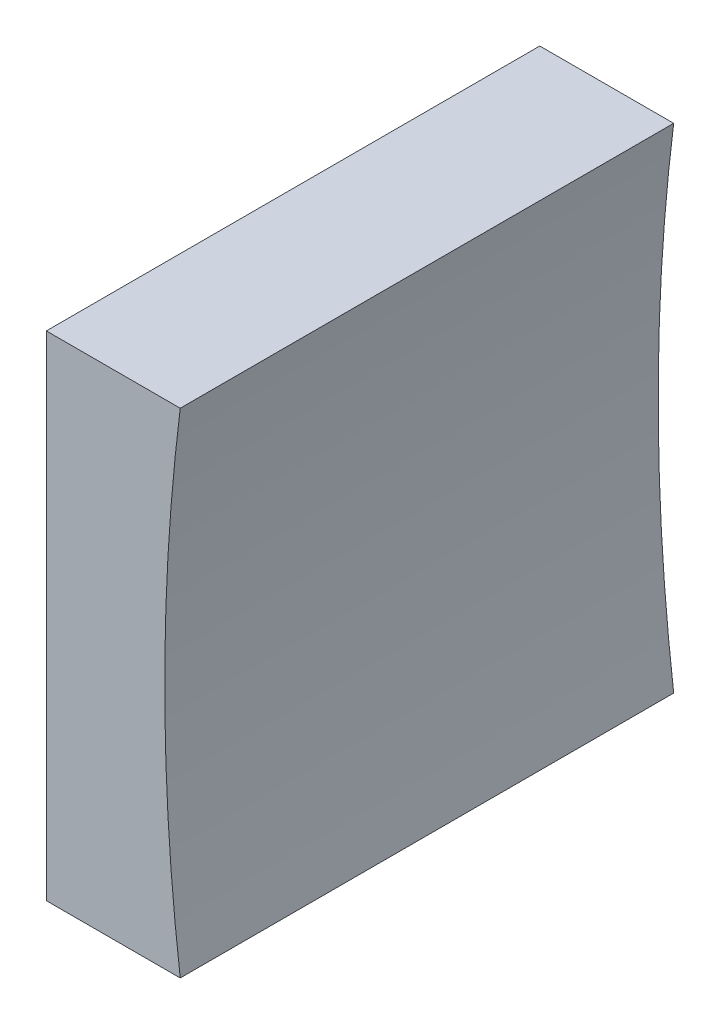
ISO-10303-21;
HEADER;
FILE_DESCRIPTION(('STEP AP214'),'2;1');
FILE_NAME('part.step','',(''),(''),'','','');
FILE_SCHEMA(('AUTOMOTIVE_DESIGN { 1 0 10303 214 1 1 1 1 }'));
ENDSEC;
DATA;
#1=APPLICATION_CONTEXT('core data for automotive mechanical design processes');
#2=APPLICATION_PROTOCOL_DEFINITION('international standard','automotive_design',2000,#1);
#3=PRODUCT_CONTEXT('',#1,'mechanical');
#4=PRODUCT('Part','Part','',(#3));
#5=PRODUCT_RELATED_PRODUCT_CATEGORY('part','',(#4));
#6=PRODUCT_DEFINITION_FORMATION('','',#4);
#7=PRODUCT_DEFINITION_CONTEXT('part definition',#1,'design');
#8=PRODUCT_DEFINITION('design','',#6,#7);
#9=PRODUCT_DEFINITION_SHAPE('','',#8);
#10=(LENGTH_UNIT() NAMED_UNIT(*) SI_UNIT(.MILLI.,.METRE.));
#11=(NAMED_UNIT(*) PLANE_ANGLE_UNIT() SI_UNIT($,.RADIAN.));
#12=(NAMED_UNIT(*) SI_UNIT($,.STERADIAN.) SOLID_ANGLE_UNIT());
#13=UNCERTAINTY_MEASURE_WITH_UNIT(LENGTH_MEASURE(1.E-05),#10,'distance_accuracy_value','');
#14=(GEOMETRIC_REPRESENTATION_CONTEXT(3) GLOBAL_UNCERTAINTY_ASSIGNED_CONTEXT((#13)) GLOBAL_UNIT_ASSIGNED_CONTEXT((#10,
#11,#12)) REPRESENTATION_CONTEXT('',''));
#15=CARTESIAN_POINT('',(0.,0.,0.));
#16=DIRECTION('',(0.,0.,1.));
#17=DIRECTION('',(1.,0.,0.));
#18=AXIS2_PLACEMENT_3D('',#15,#16,#17);
#19=CARTESIAN_POINT('',(145.745730748059,27.1789646338835,12.5));
#20=DIRECTION('',(0.,1.,0.));
#21=DIRECTION('',(0.,0.,1.));
#22=AXIS2_PLACEMENT_3D('',#19,#20,#21);
#23=PLANE('',#22);
#24=DIRECTION('',(1.,0.,0.));
#25=VECTOR('',#24,1.);
#26=CARTESIAN_POINT('',(145.745730748059,27.1789646338835,0.));
#27=LINE('',#26,#25);
#28=CARTESIAN_POINT('',(142.353567815641,27.1789646338835,0.));
#29=VERTEX_POINT('',#28);
#30=CARTESIAN_POINT('',(145.745730748059,27.1789646338836,0.));
#31=VERTEX_POINT('',#30);
#32=EDGE_CURVE('E91',#29,#31,#27,.T.);
#33=ORIENTED_EDGE('',*,*,#32,.T.);
#34=DIRECTION('',(0.,0.,-1.));
#35=VECTOR('',#34,1.);
#36=CARTESIAN_POINT('',(145.745730748059,27.1789646338836,12.5));
#37=LINE('',#36,#35);
#38=CARTESIAN_POINT('',(145.745730748059,27.1789646338836,12.5));
#39=VERTEX_POINT('',#38);
#40=EDGE_CURVE('E45',#39,#31,#37,.T.);
#41=ORIENTED_EDGE('',*,*,#40,.F.);
#42=DIRECTION('',(1.,0.,0.));
#43=VECTOR('',#42,1.);
#44=CARTESIAN_POINT('',(145.745730748059,27.1789646338835,12.5));
#45=LINE('',#44,#43);
#46=CARTESIAN_POINT('',(142.353567815641,27.1789646338835,12.5));
#47=VERTEX_POINT('',#46);
#48=EDGE_CURVE('E84',#47,#39,#45,.T.);
#49=ORIENTED_EDGE('',*,*,#48,.F.);
#50=DIRECTION('',(0.,0.,-1.));
#51=VECTOR('',#50,1.);
#52=CARTESIAN_POINT('',(142.353567815641,27.1789646338835,12.5));
#53=LINE('',#52,#51);
#54=EDGE_CURVE('E11',#47,#29,#53,.T.);
#55=ORIENTED_EDGE('',*,*,#54,.T.);
#56=EDGE_LOOP('',(#33,#41,#49,#55));
#57=FACE_BOUND('',#56,.T.);
#58=ADVANCED_FACE('F37',(#57),#23,.F.);
#59=CARTESIAN_POINT('',(195.35356783052,33.4289646338834,12.5));
#60=DIRECTION('',(0.,0.,-1.));
#61=DIRECTION('',(-1.,0.,0.));
#62=AXIS2_PLACEMENT_3D('',#59,#60,#61);
#63=CYLINDRICAL_SURFACE('',#62,50.);
#64=CARTESIAN_POINT('',(195.35356783052,33.4289646338834,0.));
#65=DIRECTION('',(0.,0.,-1.));
#66=DIRECTION('',(1.,0.,0.));
#67=AXIS2_PLACEMENT_3D('',#64,#65,#66);
#68=CIRCLE('',#67,50.);
#69=CARTESIAN_POINT('',(145.745730748059,39.6789646338835,0.));
#70=VERTEX_POINT('',#69);
#71=EDGE_CURVE('E71',#31,#70,#68,.T.);
#72=ORIENTED_EDGE('',*,*,#71,.T.);
#73=DIRECTION('',(0.,0.,-1.));
#74=VECTOR('',#73,1.);
#75=CARTESIAN_POINT('',(145.745730748059,39.6789646338835,12.5));
#76=LINE('',#75,#74);
#77=CARTESIAN_POINT('',(145.745730748059,39.6789646338835,12.5));
#78=VERTEX_POINT('',#77);
#79=EDGE_CURVE('E92',#78,#70,#76,.T.);
#80=ORIENTED_EDGE('',*,*,#79,.F.);
#81=CARTESIAN_POINT('',(195.35356783052,33.4289646338834,12.5));
#82=DIRECTION('',(0.,0.,-1.));
#83=DIRECTION('',(1.,0.,0.));
#84=AXIS2_PLACEMENT_3D('',#81,#82,#83);
#85=CIRCLE('',#84,50.);
#86=EDGE_CURVE('E88',#39,#78,#85,.T.);
#87=ORIENTED_EDGE('',*,*,#86,.F.);
#88=ORIENTED_EDGE('',*,*,#40,.T.);
#89=EDGE_LOOP('',(#72,#80,#87,#88));
#90=FACE_BOUND('',#89,.T.);
#91=ADVANCED_FACE('F93',(#90),#63,.F.);
#92=CARTESIAN_POINT('',(142.353567815641,39.6789646338835,12.5));
#93=DIRECTION('',(0.,-1.,0.));
#94=DIRECTION('',(0.,0.,-1.));
#95=AXIS2_PLACEMENT_3D('',#92,#93,#94);
#96=PLANE('',#95);
#97=DIRECTION('',(-1.,0.,0.));
#98=VECTOR('',#97,1.);
#99=CARTESIAN_POINT('',(142.353567815641,39.6789646338835,0.));
#100=LINE('',#99,#98);
#101=CARTESIAN_POINT('',(142.353567815641,39.6789646338835,0.));
#102=VERTEX_POINT('',#101);
#103=EDGE_CURVE('E78',#70,#102,#100,.T.);
#104=ORIENTED_EDGE('',*,*,#103,.T.);
#105=DIRECTION('',(0.,0.,-1.));
#106=VECTOR('',#105,1.);
#107=CARTESIAN_POINT('',(142.353567815641,39.6789646338835,12.5));
#108=LINE('',#107,#106);
#109=CARTESIAN_POINT('',(142.353567815641,39.6789646338835,12.5));
#110=VERTEX_POINT('',#109);
#111=EDGE_CURVE('E97',#110,#102,#108,.T.);
#112=ORIENTED_EDGE('',*,*,#111,.F.);
#113=DIRECTION('',(-1.,0.,0.));
#114=VECTOR('',#113,1.);
#115=CARTESIAN_POINT('',(142.353567815641,39.6789646338835,12.5));
#116=LINE('',#115,#114);
#117=EDGE_CURVE('E95',#78,#110,#116,.T.);
#118=ORIENTED_EDGE('',*,*,#117,.F.);
#119=ORIENTED_EDGE('',*,*,#79,.T.);
#120=EDGE_LOOP('',(#104,#112,#118,#119));
#121=FACE_BOUND('',#120,.T.);
#122=ADVANCED_FACE('F107',(#121),#96,.F.);
#123=CARTESIAN_POINT('',(142.353567815641,33.4289646338835,12.5));
#124=DIRECTION('',(1.,0.,0.));
#125=DIRECTION('',(0.,0.,-1.));
#126=AXIS2_PLACEMENT_3D('',#123,#124,#125);
#127=PLANE('',#126);
#128=DIRECTION('',(0.,-1.,0.));
#129=VECTOR('',#128,1.);
#130=CARTESIAN_POINT('',(142.353567815641,33.4289646338835,0.));
#131=LINE('',#130,#129);
#132=EDGE_CURVE('E104',#102,#29,#131,.T.);
#133=ORIENTED_EDGE('',*,*,#132,.T.);
#134=ORIENTED_EDGE('',*,*,#54,.F.);
#135=DIRECTION('',(0.,-1.,0.));
#136=VECTOR('',#135,1.);
#137=CARTESIAN_POINT('',(142.353567815641,27.1789646338835,12.5));
#138=LINE('',#137,#136);
#139=EDGE_CURVE('E53',#110,#47,#138,.T.);
#140=ORIENTED_EDGE('',*,*,#139,.F.);
#141=ORIENTED_EDGE('',*,*,#111,.T.);
#142=EDGE_LOOP('',(#133,#134,#140,#141));
#143=FACE_BOUND('',#142,.T.);
#144=ADVANCED_FACE('F111',(#143),#127,.F.);
#145=CARTESIAN_POINT('',(195.35356783052,33.4289646338834,12.5));
#146=DIRECTION('',(0.,0.,1.));
#147=DIRECTION('',(1.,0.,0.));
#148=AXIS2_PLACEMENT_3D('',#145,#146,#147);
#149=PLANE('',#148);
#150=ORIENTED_EDGE('',*,*,#139,.T.);
#151=ORIENTED_EDGE('',*,*,#48,.T.);
#152=ORIENTED_EDGE('',*,*,#86,.T.);
#153=ORIENTED_EDGE('',*,*,#117,.T.);
#154=EDGE_LOOP('',(#150,#151,#152,#153));
#155=FACE_BOUND('',#154,.T.);
#156=ADVANCED_FACE('F86',(#155),#149,.T.);
#157=CARTESIAN_POINT('',(195.35356783052,33.4289646338834,0.));
#158=DIRECTION('',(0.,0.,1.));
#159=DIRECTION('',(1.,0.,0.));
#160=AXIS2_PLACEMENT_3D('',#157,#158,#159);
#161=PLANE('',#160);
#162=ORIENTED_EDGE('',*,*,#32,.F.);
#163=ORIENTED_EDGE('',*,*,#132,.F.);
#164=ORIENTED_EDGE('',*,*,#103,.F.);
#165=ORIENTED_EDGE('',*,*,#71,.F.);
#166=EDGE_LOOP('',(#162,#163,#164,#165));
#167=FACE_BOUND('',#166,.T.);
#168=ADVANCED_FACE('F110',(#167),#161,.F.);
#169=CLOSED_SHELL('',(#58,#91,#122,#144,#156,#168));
#170=MANIFOLD_SOLID_BREP('B2',#169);
#171=ADVANCED_BREP_SHAPE_REPRESENTATION('',(#18,#170),#14);
#172=SHAPE_DEFINITION_REPRESENTATION(#9,#171);
ENDSEC;
END-ISO-10303-21;
